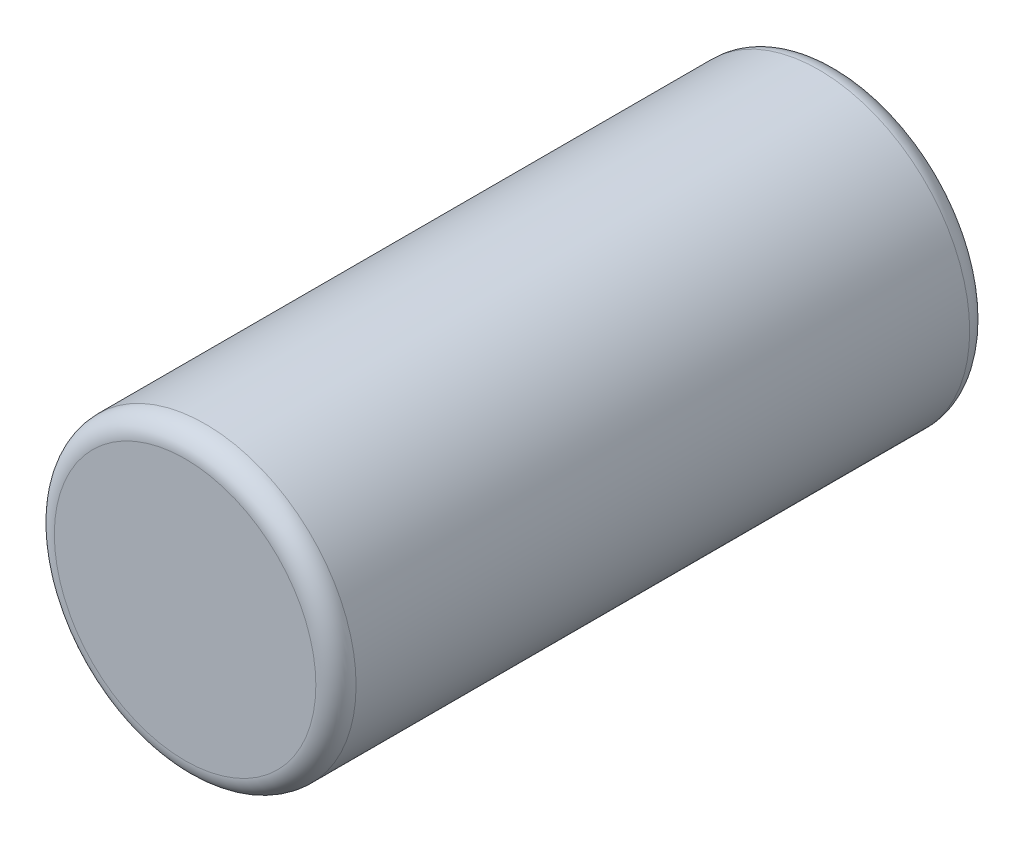
ISO-10303-21;
HEADER;
FILE_DESCRIPTION(('STEP AP214'),'2;1');
FILE_NAME('part.step','',(''),(''),'','','');
FILE_SCHEMA(('AUTOMOTIVE_DESIGN { 1 0 10303 214 1 1 1 1 }'));
ENDSEC;
DATA;
#1=APPLICATION_CONTEXT('core data for automotive mechanical design processes');
#2=APPLICATION_PROTOCOL_DEFINITION('international standard','automotive_design',2000,#1);
#3=PRODUCT_CONTEXT('',#1,'mechanical');
#4=PRODUCT('Part','Part','',(#3));
#5=PRODUCT_RELATED_PRODUCT_CATEGORY('part','',(#4));
#6=PRODUCT_DEFINITION_FORMATION('','',#4);
#7=PRODUCT_DEFINITION_CONTEXT('part definition',#1,'design');
#8=PRODUCT_DEFINITION('design','',#6,#7);
#9=PRODUCT_DEFINITION_SHAPE('','',#8);
#10=(LENGTH_UNIT() NAMED_UNIT(*) SI_UNIT(.MILLI.,.METRE.));
#11=(NAMED_UNIT(*) PLANE_ANGLE_UNIT() SI_UNIT($,.RADIAN.));
#12=(NAMED_UNIT(*) SI_UNIT($,.STERADIAN.) SOLID_ANGLE_UNIT());
#13=UNCERTAINTY_MEASURE_WITH_UNIT(LENGTH_MEASURE(1.E-05),#10,'distance_accuracy_value','');
#14=(GEOMETRIC_REPRESENTATION_CONTEXT(3) GLOBAL_UNCERTAINTY_ASSIGNED_CONTEXT((#13)) GLOBAL_UNIT_ASSIGNED_CONTEXT((#10,
#11,#12)) REPRESENTATION_CONTEXT('',''));
#15=CARTESIAN_POINT('',(0.,0.,0.));
#16=DIRECTION('',(0.,0.,1.));
#17=DIRECTION('',(1.,0.,0.));
#18=AXIS2_PLACEMENT_3D('',#15,#16,#17);
#19=CARTESIAN_POINT('',(0.,0.,6.5));
#20=DIRECTION('',(0.,0.,-1.));
#21=DIRECTION('',(-1.,0.,0.));
#22=AXIS2_PLACEMENT_3D('',#19,#20,#21);
#23=CYLINDRICAL_SURFACE('',#22,1.5);
#24=CARTESIAN_POINT('',(0.,0.,0.2));
#25=DIRECTION('',(0.,0.,1.));
#26=DIRECTION('',(1.,0.,0.));
#27=AXIS2_PLACEMENT_3D('',#24,#25,#26);
#28=CIRCLE('',#27,1.5);
#29=CARTESIAN_POINT('',(1.5,0.,0.2));
#30=VERTEX_POINT('',#29);
#31=EDGE_CURVE('E41',#30,#30,#28,.T.);
#32=ORIENTED_EDGE('',*,*,#31,.T.);
#33=EDGE_LOOP('',(#32));
#34=FACE_BOUND('',#33,.T.);
#35=CARTESIAN_POINT('',(0.,0.,6.3));
#36=DIRECTION('',(0.,0.,1.));
#37=DIRECTION('',(1.,0.,0.));
#38=AXIS2_PLACEMENT_3D('',#35,#36,#37);
#39=CIRCLE('',#38,1.5);
#40=CARTESIAN_POINT('',(1.5,0.,6.3));
#41=VERTEX_POINT('',#40);
#42=EDGE_CURVE('E45',#41,#41,#39,.F.);
#43=ORIENTED_EDGE('',*,*,#42,.T.);
#44=EDGE_LOOP('',(#43));
#45=FACE_BOUND('',#44,.T.);
#46=ADVANCED_FACE('F30',(#34,#45),#23,.T.);
#47=CARTESIAN_POINT('',(0.,0.,6.5));
#48=DIRECTION('',(0.,0.,1.));
#49=DIRECTION('',(1.,0.,0.));
#50=AXIS2_PLACEMENT_3D('',#47,#48,#49);
#51=PLANE('',#50);
#52=CARTESIAN_POINT('',(0.,0.,6.5));
#53=DIRECTION('',(0.,0.,1.));
#54=DIRECTION('',(1.,0.,0.));
#55=AXIS2_PLACEMENT_3D('',#52,#53,#54);
#56=CIRCLE('',#55,1.3);
#57=CARTESIAN_POINT('',(1.3,0.,6.5));
#58=VERTEX_POINT('',#57);
#59=EDGE_CURVE('E10',#58,#58,#56,.T.);
#60=ORIENTED_EDGE('',*,*,#59,.T.);
#61=EDGE_LOOP('',(#60));
#62=FACE_BOUND('',#61,.T.);
#63=ADVANCED_FACE('F61',(#62),#51,.T.);
#64=CARTESIAN_POINT('',(0.,0.,0.));
#65=DIRECTION('',(0.,0.,1.));
#66=DIRECTION('',(1.,0.,0.));
#67=AXIS2_PLACEMENT_3D('',#64,#65,#66);
#68=PLANE('',#67);
#69=CARTESIAN_POINT('',(0.,0.,0.));
#70=DIRECTION('',(0.,0.,1.));
#71=DIRECTION('',(1.,0.,0.));
#72=AXIS2_PLACEMENT_3D('',#69,#70,#71);
#73=CIRCLE('',#72,1.3);
#74=CARTESIAN_POINT('',(1.3,0.,0.));
#75=VERTEX_POINT('',#74);
#76=EDGE_CURVE('E37',#75,#75,#73,.F.);
#77=ORIENTED_EDGE('',*,*,#76,.T.);
#78=EDGE_LOOP('',(#77));
#79=FACE_BOUND('',#78,.T.);
#80=ADVANCED_FACE('F58',(#79),#68,.F.);
#81=CARTESIAN_POINT('',(0.,0.,0.2));
#82=DIRECTION('',(0.,0.,1.));
#83=DIRECTION('',(1.,0.,0.));
#84=AXIS2_PLACEMENT_3D('',#81,#82,#83);
#85=TOROIDAL_SURFACE('',#84,1.3,0.2);
#86=ORIENTED_EDGE('',*,*,#76,.F.);
#87=EDGE_LOOP('',(#86));
#88=FACE_BOUND('',#87,.T.);
#89=ORIENTED_EDGE('',*,*,#31,.F.);
#90=EDGE_LOOP('',(#89));
#91=FACE_BOUND('',#90,.T.);
#92=ADVANCED_FACE('F54',(#88,#91),#85,.T.);
#93=CARTESIAN_POINT('',(0.,0.,6.3));
#94=DIRECTION('',(0.,0.,1.));
#95=DIRECTION('',(1.,0.,0.));
#96=AXIS2_PLACEMENT_3D('',#93,#94,#95);
#97=TOROIDAL_SURFACE('',#96,1.3,0.2);
#98=ORIENTED_EDGE('',*,*,#42,.F.);
#99=EDGE_LOOP('',(#98));
#100=FACE_BOUND('',#99,.T.);
#101=ORIENTED_EDGE('',*,*,#59,.F.);
#102=EDGE_LOOP('',(#101));
#103=FACE_BOUND('',#102,.T.);
#104=ADVANCED_FACE('F32',(#100,#103),#97,.T.);
#105=CLOSED_SHELL('',(#46,#63,#80,#92,#104));
#106=MANIFOLD_SOLID_BREP('B2',#105);
#107=ADVANCED_BREP_SHAPE_REPRESENTATION('',(#18,#106),#14);
#108=SHAPE_DEFINITION_REPRESENTATION(#9,#107);
ENDSEC;
END-ISO-10303-21;
